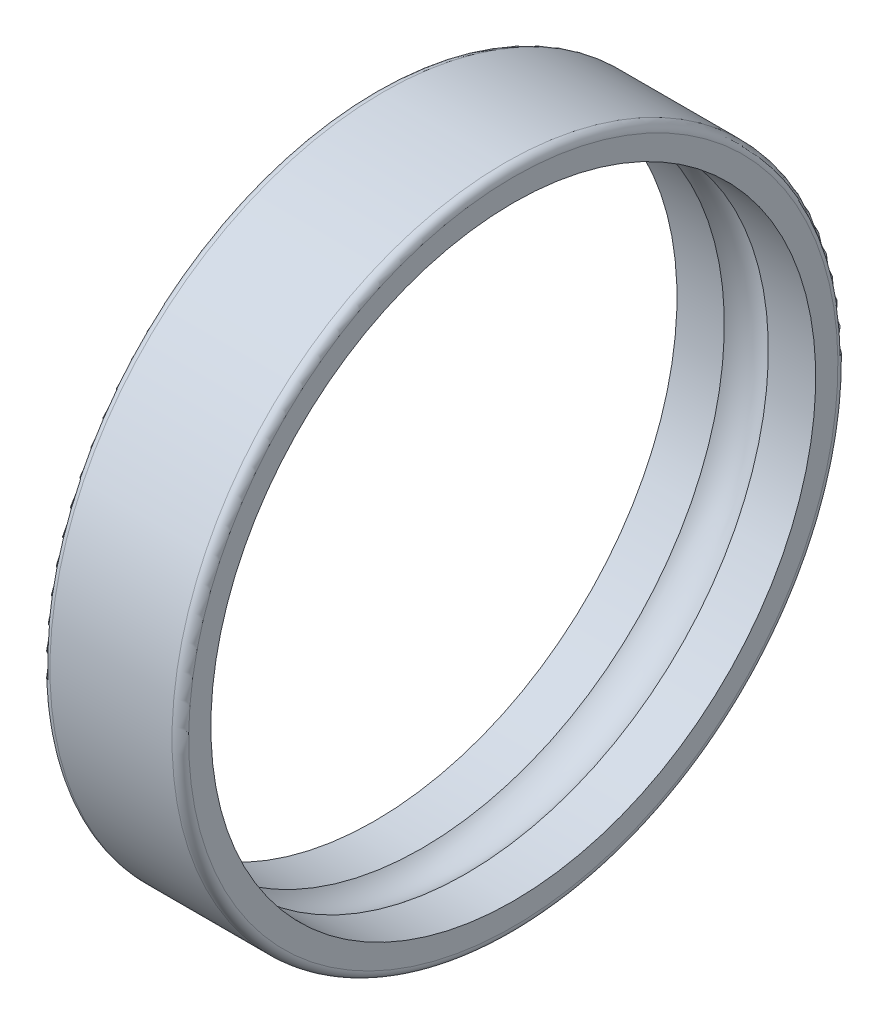
ISO-10303-21;
HEADER;
FILE_DESCRIPTION(('STEP AP214'),'2;1');
FILE_NAME('part.step','',(''),(''),'','','');
FILE_SCHEMA(('AUTOMOTIVE_DESIGN { 1 0 10303 214 1 1 1 1 }'));
ENDSEC;
DATA;
#1=APPLICATION_CONTEXT('core data for automotive mechanical design processes');
#2=APPLICATION_PROTOCOL_DEFINITION('international standard','automotive_design',2000,#1);
#3=PRODUCT_CONTEXT('',#1,'mechanical');
#4=PRODUCT('Part','Part','',(#3));
#5=PRODUCT_RELATED_PRODUCT_CATEGORY('part','',(#4));
#6=PRODUCT_DEFINITION_FORMATION('','',#4);
#7=PRODUCT_DEFINITION_CONTEXT('part definition',#1,'design');
#8=PRODUCT_DEFINITION('design','',#6,#7);
#9=PRODUCT_DEFINITION_SHAPE('','',#8);
#10=(LENGTH_UNIT() NAMED_UNIT(*) SI_UNIT(.MILLI.,.METRE.));
#11=(NAMED_UNIT(*) PLANE_ANGLE_UNIT() SI_UNIT($,.RADIAN.));
#12=(NAMED_UNIT(*) SI_UNIT($,.STERADIAN.) SOLID_ANGLE_UNIT());
#13=UNCERTAINTY_MEASURE_WITH_UNIT(LENGTH_MEASURE(1.E-05),#10,'distance_accuracy_value','');
#14=(GEOMETRIC_REPRESENTATION_CONTEXT(3) GLOBAL_UNCERTAINTY_ASSIGNED_CONTEXT((#13)) GLOBAL_UNIT_ASSIGNED_CONTEXT((#10,
#11,#12)) REPRESENTATION_CONTEXT('',''));
#15=CARTESIAN_POINT('',(0.,0.,0.));
#16=DIRECTION('',(0.,0.,1.));
#17=DIRECTION('',(1.,0.,0.));
#18=AXIS2_PLACEMENT_3D('',#15,#16,#17);
#19=CARTESIAN_POINT('',(2.07343134832985,0.,0.));
#20=DIRECTION('',(-1.,0.,0.));
#21=DIRECTION('',(0.,1.,0.));
#22=AXIS2_PLACEMENT_3D('',#19,#20,#21);
#23=CYLINDRICAL_SURFACE('',#22,5.45);
#24=CARTESIAN_POINT('',(2.5,0.,0.));
#25=DIRECTION('',(1.,0.,0.));
#26=DIRECTION('',(0.,1.,0.));
#27=AXIS2_PLACEMENT_3D('',#24,#25,#26);
#28=CIRCLE('',#27,5.45);
#29=CARTESIAN_POINT('',(2.5,5.45,0.));
#30=VERTEX_POINT('',#29);
#31=EDGE_CURVE('E11',#30,#30,#28,.T.);
#32=ORIENTED_EDGE('',*,*,#31,.T.);
#33=EDGE_LOOP('',(#32));
#34=FACE_BOUND('',#33,.T.);
#35=CARTESIAN_POINT('',(1.64686269665969,0.,0.));
#36=DIRECTION('',(1.,0.,0.));
#37=DIRECTION('',(0.,1.,0.));
#38=AXIS2_PLACEMENT_3D('',#35,#36,#37);
#39=CIRCLE('',#38,5.45);
#40=CARTESIAN_POINT('',(1.64686269665969,5.45,0.));
#41=VERTEX_POINT('',#40);
#42=EDGE_CURVE('E64',#41,#41,#39,.T.);
#43=ORIENTED_EDGE('',*,*,#42,.F.);
#44=EDGE_LOOP('',(#43));
#45=FACE_BOUND('',#44,.T.);
#46=ADVANCED_FACE('F16',(#34,#45),#23,.F.);
#47=CARTESIAN_POINT('',(2.5,5.65,0.));
#48=DIRECTION('',(1.,0.,0.));
#49=DIRECTION('',(0.,1.,0.));
#50=AXIS2_PLACEMENT_3D('',#47,#48,#49);
#51=PLANE('',#50);
#52=CARTESIAN_POINT('',(2.5,0.,0.));
#53=DIRECTION('',(1.,0.,0.));
#54=DIRECTION('',(0.,1.,0.));
#55=AXIS2_PLACEMENT_3D('',#52,#53,#54);
#56=CIRCLE('',#55,5.85);
#57=CARTESIAN_POINT('',(2.5,5.85,0.));
#58=VERTEX_POINT('',#57);
#59=EDGE_CURVE('E26',#58,#58,#56,.T.);
#60=ORIENTED_EDGE('',*,*,#59,.T.);
#61=EDGE_LOOP('',(#60));
#62=FACE_BOUND('',#61,.T.);
#63=ORIENTED_EDGE('',*,*,#31,.F.);
#64=EDGE_LOOP('',(#63));
#65=FACE_BOUND('',#64,.T.);
#66=ADVANCED_FACE('F18',(#62,#65),#51,.T.);
#67=CARTESIAN_POINT('',(2.35,0.,0.));
#68=DIRECTION('',(1.,0.,0.));
#69=DIRECTION('',(0.,0.,-1.));
#70=AXIS2_PLACEMENT_3D('',#67,#68,#69);
#71=TOROIDAL_SURFACE('',#70,5.85,0.15);
#72=CARTESIAN_POINT('',(2.35,0.,0.));
#73=DIRECTION('',(1.,0.,0.));
#74=DIRECTION('',(0.,1.,0.));
#75=AXIS2_PLACEMENT_3D('',#72,#73,#74);
#76=CIRCLE('',#75,6.);
#77=CARTESIAN_POINT('',(2.35,6.,0.));
#78=VERTEX_POINT('',#77);
#79=EDGE_CURVE('E52',#78,#78,#76,.T.);
#80=ORIENTED_EDGE('',*,*,#79,.T.);
#81=EDGE_LOOP('',(#80));
#82=FACE_BOUND('',#81,.T.);
#83=ORIENTED_EDGE('',*,*,#59,.F.);
#84=EDGE_LOOP('',(#83));
#85=FACE_BOUND('',#84,.T.);
#86=ADVANCED_FACE('F53',(#82,#85),#71,.T.);
#87=CARTESIAN_POINT('',(1.25,0.,0.));
#88=DIRECTION('',(-1.,0.,0.));
#89=DIRECTION('',(0.,1.,0.));
#90=AXIS2_PLACEMENT_3D('',#87,#88,#89);
#91=CYLINDRICAL_SURFACE('',#90,6.);
#92=CARTESIAN_POINT('',(0.15,0.,0.));
#93=DIRECTION('',(1.,0.,0.));
#94=DIRECTION('',(0.,1.,0.));
#95=AXIS2_PLACEMENT_3D('',#92,#93,#94);
#96=CIRCLE('',#95,6.);
#97=CARTESIAN_POINT('',(0.15,6.,0.));
#98=VERTEX_POINT('',#97);
#99=EDGE_CURVE('E48',#98,#98,#96,.T.);
#100=ORIENTED_EDGE('',*,*,#99,.T.);
#101=EDGE_LOOP('',(#100));
#102=FACE_BOUND('',#101,.T.);
#103=ORIENTED_EDGE('',*,*,#79,.F.);
#104=EDGE_LOOP('',(#103));
#105=FACE_BOUND('',#104,.T.);
#106=ADVANCED_FACE('F88',(#102,#105),#91,.T.);
#107=CARTESIAN_POINT('',(0.15,0.,0.));
#108=DIRECTION('',(1.,0.,0.));
#109=DIRECTION('',(0.,0.,-1.));
#110=AXIS2_PLACEMENT_3D('',#107,#108,#109);
#111=TOROIDAL_SURFACE('',#110,5.85,0.15);
#112=CARTESIAN_POINT('',(0.,0.,0.));
#113=DIRECTION('',(1.,0.,0.));
#114=DIRECTION('',(0.,1.,0.));
#115=AXIS2_PLACEMENT_3D('',#112,#113,#114);
#116=CIRCLE('',#115,5.85);
#117=CARTESIAN_POINT('',(0.,5.85,0.));
#118=VERTEX_POINT('',#117);
#119=EDGE_CURVE('E20',#118,#118,#116,.T.);
#120=ORIENTED_EDGE('',*,*,#119,.T.);
#121=EDGE_LOOP('',(#120));
#122=FACE_BOUND('',#121,.T.);
#123=ORIENTED_EDGE('',*,*,#99,.F.);
#124=EDGE_LOOP('',(#123));
#125=FACE_BOUND('',#124,.T.);
#126=ADVANCED_FACE('F74',(#122,#125),#111,.T.);
#127=CARTESIAN_POINT('',(0.,5.65,0.));
#128=DIRECTION('',(-1.,0.,0.));
#129=DIRECTION('',(0.,-1.,0.));
#130=AXIS2_PLACEMENT_3D('',#127,#128,#129);
#131=PLANE('',#130);
#132=CARTESIAN_POINT('',(0.,0.,0.));
#133=DIRECTION('',(1.,0.,0.));
#134=DIRECTION('',(0.,1.,0.));
#135=AXIS2_PLACEMENT_3D('',#132,#133,#134);
#136=CIRCLE('',#135,5.45);
#137=CARTESIAN_POINT('',(0.,5.45,0.));
#138=VERTEX_POINT('',#137);
#139=EDGE_CURVE('E60',#138,#138,#136,.T.);
#140=ORIENTED_EDGE('',*,*,#139,.T.);
#141=EDGE_LOOP('',(#140));
#142=FACE_BOUND('',#141,.T.);
#143=ORIENTED_EDGE('',*,*,#119,.F.);
#144=EDGE_LOOP('',(#143));
#145=FACE_BOUND('',#144,.T.);
#146=ADVANCED_FACE('F77',(#142,#145),#131,.T.);
#147=CARTESIAN_POINT('',(0.426568651670155,0.,0.));
#148=DIRECTION('',(-1.,0.,0.));
#149=DIRECTION('',(0.,1.,0.));
#150=AXIS2_PLACEMENT_3D('',#147,#148,#149);
#151=CYLINDRICAL_SURFACE('',#150,5.45);
#152=CARTESIAN_POINT('',(0.85313730334031,0.,0.));
#153=DIRECTION('',(1.,0.,0.));
#154=DIRECTION('',(0.,1.,0.));
#155=AXIS2_PLACEMENT_3D('',#152,#153,#154);
#156=CIRCLE('',#155,5.45);
#157=CARTESIAN_POINT('',(0.85313730334031,5.45,0.));
#158=VERTEX_POINT('',#157);
#159=EDGE_CURVE('E63',#158,#158,#156,.T.);
#160=ORIENTED_EDGE('',*,*,#159,.T.);
#161=EDGE_LOOP('',(#160));
#162=FACE_BOUND('',#161,.T.);
#163=ORIENTED_EDGE('',*,*,#139,.F.);
#164=EDGE_LOOP('',(#163));
#165=FACE_BOUND('',#164,.T.);
#166=ADVANCED_FACE('F79',(#162,#165),#151,.F.);
#167=CARTESIAN_POINT('',(1.25,0.,0.));
#168=DIRECTION('',(1.,0.,0.));
#169=DIRECTION('',(0.,0.,-1.));
#170=AXIS2_PLACEMENT_3D('',#167,#168,#169);
#171=TOROIDAL_SURFACE('',#170,5.,0.6);
#172=ORIENTED_EDGE('',*,*,#42,.T.);
#173=EDGE_LOOP('',(#172));
#174=FACE_BOUND('',#173,.T.);
#175=ORIENTED_EDGE('',*,*,#159,.F.);
#176=EDGE_LOOP('',(#175));
#177=FACE_BOUND('',#176,.T.);
#178=ADVANCED_FACE('F86',(#174,#177),#171,.F.);
#179=CLOSED_SHELL('',(#46,#66,#86,#106,#126,#146,#166,#178));
#180=MANIFOLD_SOLID_BREP('B1',#179);
#181=ADVANCED_BREP_SHAPE_REPRESENTATION('',(#18,#180),#14);
#182=SHAPE_DEFINITION_REPRESENTATION(#9,#181);
ENDSEC;
END-ISO-10303-21;
